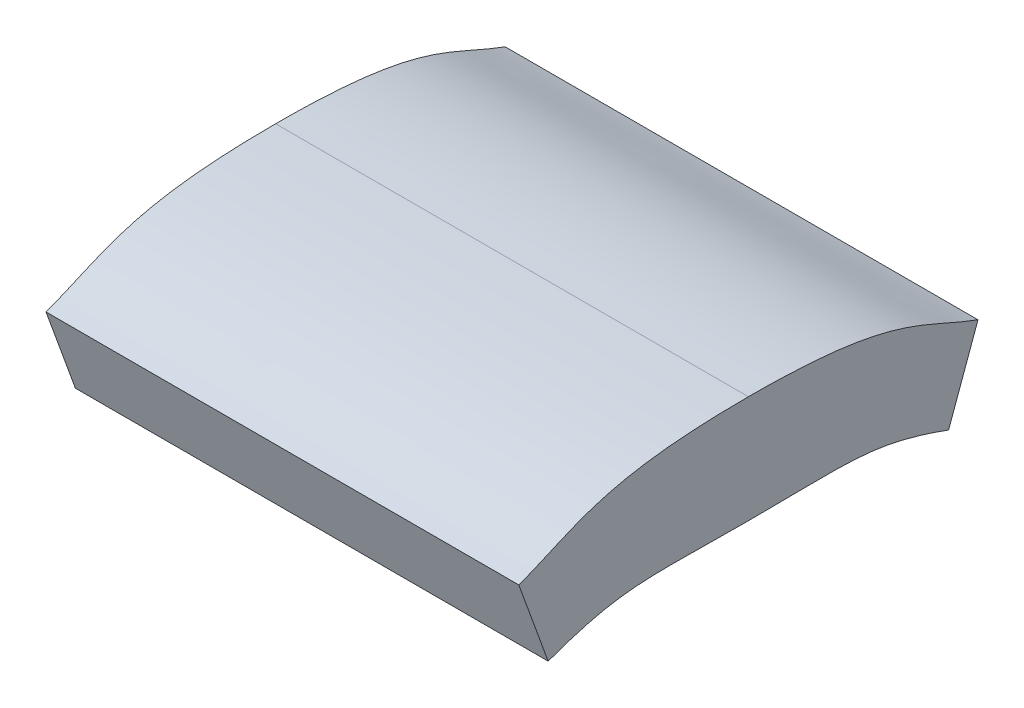
ISO-10303-21;
HEADER;
FILE_DESCRIPTION(('STEP AP214'),'2;1');
FILE_NAME('part.step','',(''),(''),'','','');
FILE_SCHEMA(('AUTOMOTIVE_DESIGN { 1 0 10303 214 1 1 1 1 }'));
ENDSEC;
DATA;
#1=APPLICATION_CONTEXT('core data for automotive mechanical design processes');
#2=APPLICATION_PROTOCOL_DEFINITION('international standard','automotive_design',2000,#1);
#3=PRODUCT_CONTEXT('',#1,'mechanical');
#4=PRODUCT('Part','Part','',(#3));
#5=PRODUCT_RELATED_PRODUCT_CATEGORY('part','',(#4));
#6=PRODUCT_DEFINITION_FORMATION('','',#4);
#7=PRODUCT_DEFINITION_CONTEXT('part definition',#1,'design');
#8=PRODUCT_DEFINITION('design','',#6,#7);
#9=PRODUCT_DEFINITION_SHAPE('','',#8);
#10=(LENGTH_UNIT() NAMED_UNIT(*) SI_UNIT(.MILLI.,.METRE.));
#11=(NAMED_UNIT(*) PLANE_ANGLE_UNIT() SI_UNIT($,.RADIAN.));
#12=(NAMED_UNIT(*) SI_UNIT($,.STERADIAN.) SOLID_ANGLE_UNIT());
#13=UNCERTAINTY_MEASURE_WITH_UNIT(LENGTH_MEASURE(1.E-05),#10,'distance_accuracy_value','');
#14=(GEOMETRIC_REPRESENTATION_CONTEXT(3) GLOBAL_UNCERTAINTY_ASSIGNED_CONTEXT((#13)) GLOBAL_UNIT_ASSIGNED_CONTEXT((#10,
#11,#12)) REPRESENTATION_CONTEXT('',''));
#15=CARTESIAN_POINT('',(0.,0.,0.));
#16=DIRECTION('',(0.,0.,1.));
#17=DIRECTION('',(1.,0.,0.));
#18=AXIS2_PLACEMENT_3D('',#15,#16,#17);
#19=CARTESIAN_POINT('',(22.,0.0220731014368565,0.));
#20=CARTESIAN_POINT('',(22.,0.0220731014368516,-4.68519401212058));
#21=CARTESIAN_POINT('',(22.,0.312622202267794,-5.7702052001182));
#22=CARTESIAN_POINT('',(22.,-0.977926898563144,-9.31595971334866));
#23=B_SPLINE_CURVE_WITH_KNOTS('',3,(#19,#20,#21,#22),.UNSPECIFIED.,.F.,.F.,(4,4),(0.,1.),.UNSPECIFIED.);
#24=DIRECTION('',(-1.,0.,0.));
#25=VECTOR('',#24,1.);
#26=SURFACE_OF_LINEAR_EXTRUSION('',#23,#25);
#27=CARTESIAN_POINT('',(0.,0.0220731014368565,0.));
#28=CARTESIAN_POINT('',(0.,0.0220731014368516,-4.68519401212058));
#29=CARTESIAN_POINT('',(0.,0.312622202267794,-5.7702052001182));
#30=CARTESIAN_POINT('',(0.,-0.977926898563144,-9.31595971334866));
#31=B_SPLINE_CURVE_WITH_KNOTS('',3,(#27,#28,#29,#30),.UNSPECIFIED.,.F.,.F.,(4,4),(0.,1.),.UNSPECIFIED.);
#32=CARTESIAN_POINT('',(0.,0.0220731014368565,0.));
#33=VERTEX_POINT('',#32);
#34=CARTESIAN_POINT('',(0.,-0.977926898563144,-9.31595971334866));
#35=VERTEX_POINT('',#34);
#36=EDGE_CURVE('E124',#33,#35,#31,.T.);
#37=ORIENTED_EDGE('',*,*,#36,.T.);
#38=DIRECTION('',(-1.,0.,0.));
#39=VECTOR('',#38,1.);
#40=CARTESIAN_POINT('',(22.,-0.977926898563144,-9.31595971334866));
#41=LINE('',#40,#39);
#42=CARTESIAN_POINT('',(22.,-0.977926898563144,-9.31595971334866));
#43=VERTEX_POINT('',#42);
#44=EDGE_CURVE('E11',#43,#35,#41,.T.);
#45=ORIENTED_EDGE('',*,*,#44,.F.);
#46=CARTESIAN_POINT('',(22.,0.0220731014368565,0.));
#47=VERTEX_POINT('',#46);
#48=EDGE_CURVE('E153',#47,#43,#23,.T.);
#49=ORIENTED_EDGE('',*,*,#48,.F.);
#50=DIRECTION('',(-1.,0.,0.));
#51=VECTOR('',#50,1.);
#52=CARTESIAN_POINT('',(22.,0.0220731014368565,0.));
#53=LINE('',#52,#51);
#54=EDGE_CURVE('E114',#47,#33,#53,.T.);
#55=ORIENTED_EDGE('',*,*,#54,.T.);
#56=EDGE_LOOP('',(#37,#45,#49,#55));
#57=FACE_BOUND('',#56,.T.);
#58=ADVANCED_FACE('F33',(#57),#26,.F.);
#59=CARTESIAN_POINT('',(22.,-0.977926898563144,-9.31595971334866));
#60=DIRECTION('',(0.,0.342020143325669,0.939692620785908));
#61=DIRECTION('',(0.,-0.939692620785908,0.342020143325669));
#62=AXIS2_PLACEMENT_3D('',#59,#60,#61);
#63=PLANE('',#62);
#64=DIRECTION('',(0.,0.939692620785908,-0.342020143325669));
#65=VECTOR('',#64,1.);
#66=CARTESIAN_POINT('',(0.,-0.977926898563144,-9.31595971334866));
#67=LINE('',#66,#65);
#68=CARTESIAN_POINT('',(0.,2.78084358458049,-10.6840402866513));
#69=VERTEX_POINT('',#68);
#70=EDGE_CURVE('E178',#35,#69,#67,.T.);
#71=ORIENTED_EDGE('',*,*,#70,.T.);
#72=DIRECTION('',(-1.,0.,0.));
#73=VECTOR('',#72,1.);
#74=CARTESIAN_POINT('',(22.,2.78084358458049,-10.6840402866513));
#75=LINE('',#74,#73);
#76=CARTESIAN_POINT('',(22.,2.78084358458049,-10.6840402866513));
#77=VERTEX_POINT('',#76);
#78=EDGE_CURVE('E42',#77,#69,#75,.T.);
#79=ORIENTED_EDGE('',*,*,#78,.F.);
#80=DIRECTION('',(0.,0.939692620785908,-0.342020143325669));
#81=VECTOR('',#80,1.);
#82=CARTESIAN_POINT('',(22.,-0.977926898563144,-9.31595971334866));
#83=LINE('',#82,#81);
#84=EDGE_CURVE('E87',#43,#77,#83,.T.);
#85=ORIENTED_EDGE('',*,*,#84,.F.);
#86=ORIENTED_EDGE('',*,*,#44,.T.);
#87=EDGE_LOOP('',(#71,#79,#85,#86));
#88=FACE_BOUND('',#87,.T.);
#89=ADVANCED_FACE('F144',(#88),#63,.F.);
#90=CARTESIAN_POINT('',(22.,2.78084358458049,-10.6840402866513));
#91=CARTESIAN_POINT('',(22.,3.75213658486236,-8.01543470070257));
#92=CARTESIAN_POINT('',(22.,5.02207310143686,-6.88706405070165));
#93=CARTESIAN_POINT('',(22.,5.02207310143686,0.));
#94=B_SPLINE_CURVE_WITH_KNOTS('',3,(#90,#91,#92,#93),.UNSPECIFIED.,.F.,.F.,(4,4),(0.,1.),.UNSPECIFIED.);
#95=DIRECTION('',(-1.,0.,0.));
#96=VECTOR('',#95,1.);
#97=SURFACE_OF_LINEAR_EXTRUSION('',#94,#96);
#98=CARTESIAN_POINT('',(0.,2.78084358458049,-10.6840402866513));
#99=CARTESIAN_POINT('',(0.,3.75213658486236,-8.01543470070257));
#100=CARTESIAN_POINT('',(0.,5.02207310143686,-6.88706405070165));
#101=CARTESIAN_POINT('',(0.,5.02207310143686,0.));
#102=B_SPLINE_CURVE_WITH_KNOTS('',3,(#98,#99,#100,#101),.UNSPECIFIED.,.F.,.F.,(4,4),(0.,1.),.UNSPECIFIED.);
#103=CARTESIAN_POINT('',(0.,5.02207310143686,0.));
#104=VERTEX_POINT('',#103);
#105=EDGE_CURVE('E175',#69,#104,#102,.T.);
#106=ORIENTED_EDGE('',*,*,#105,.T.);
#107=DIRECTION('',(-1.,0.,0.));
#108=VECTOR('',#107,1.);
#109=CARTESIAN_POINT('',(22.,5.02207310143686,0.));
#110=LINE('',#109,#108);
#111=CARTESIAN_POINT('',(22.,5.02207310143686,0.));
#112=VERTEX_POINT('',#111);
#113=EDGE_CURVE('E109',#112,#104,#110,.T.);
#114=ORIENTED_EDGE('',*,*,#113,.F.);
#115=EDGE_CURVE('E100',#77,#112,#94,.T.);
#116=ORIENTED_EDGE('',*,*,#115,.F.);
#117=ORIENTED_EDGE('',*,*,#78,.T.);
#118=EDGE_LOOP('',(#106,#114,#116,#117));
#119=FACE_BOUND('',#118,.T.);
#120=ADVANCED_FACE('F142',(#119),#97,.F.);
#121=CARTESIAN_POINT('',(22.,5.02207310143686,0.));
#122=CARTESIAN_POINT('',(22.,5.02207310143686,6.88706405070165));
#123=CARTESIAN_POINT('',(22.,3.75213658486236,8.01543470070257));
#124=CARTESIAN_POINT('',(22.,2.78084358458049,10.6840402866513));
#125=B_SPLINE_CURVE_WITH_KNOTS('',3,(#121,#122,#123,#124),.UNSPECIFIED.,.F.,.F.,(4,4),(0.,1.),.UNSPECIFIED.);
#126=DIRECTION('',(-1.,0.,0.));
#127=VECTOR('',#126,1.);
#128=SURFACE_OF_LINEAR_EXTRUSION('',#125,#127);
#129=CARTESIAN_POINT('',(0.,5.02207310143686,0.));
#130=CARTESIAN_POINT('',(0.,5.02207310143686,6.88706405070165));
#131=CARTESIAN_POINT('',(0.,3.75213658486236,8.01543470070257));
#132=CARTESIAN_POINT('',(0.,2.78084358458049,10.6840402866513));
#133=B_SPLINE_CURVE_WITH_KNOTS('',3,(#129,#130,#131,#132),.UNSPECIFIED.,.F.,.F.,(4,4),(0.,1.),.UNSPECIFIED.);
#134=CARTESIAN_POINT('',(0.,2.78084358458049,10.6840402866513));
#135=VERTEX_POINT('',#134);
#136=EDGE_CURVE('E108',#104,#135,#133,.T.);
#137=ORIENTED_EDGE('',*,*,#136,.T.);
#138=DIRECTION('',(-1.,0.,0.));
#139=VECTOR('',#138,1.);
#140=CARTESIAN_POINT('',(22.,2.78084358458049,10.6840402866513));
#141=LINE('',#140,#139);
#142=CARTESIAN_POINT('',(22.,2.78084358458049,10.6840402866513));
#143=VERTEX_POINT('',#142);
#144=EDGE_CURVE('E105',#143,#135,#141,.T.);
#145=ORIENTED_EDGE('',*,*,#144,.F.);
#146=EDGE_CURVE('E94',#112,#143,#125,.T.);
#147=ORIENTED_EDGE('',*,*,#146,.F.);
#148=ORIENTED_EDGE('',*,*,#113,.T.);
#149=EDGE_LOOP('',(#137,#145,#147,#148));
#150=FACE_BOUND('',#149,.T.);
#151=ADVANCED_FACE('F106',(#150),#128,.F.);
#152=CARTESIAN_POINT('',(22.,-0.977926898563144,9.31595971334866));
#153=DIRECTION('',(0.,0.342020143325669,-0.939692620785908));
#154=DIRECTION('',(0.,0.939692620785908,0.342020143325669));
#155=AXIS2_PLACEMENT_3D('',#152,#153,#154);
#156=PLANE('',#155);
#157=DIRECTION('',(0.,-0.939692620785908,-0.342020143325669));
#158=VECTOR('',#157,1.);
#159=CARTESIAN_POINT('',(0.,-0.977926898563144,9.31595971334866));
#160=LINE('',#159,#158);
#161=CARTESIAN_POINT('',(0.,-0.977926898563144,9.31595971334866));
#162=VERTEX_POINT('',#161);
#163=EDGE_CURVE('E73',#135,#162,#160,.T.);
#164=ORIENTED_EDGE('',*,*,#163,.T.);
#165=DIRECTION('',(-1.,0.,0.));
#166=VECTOR('',#165,1.);
#167=CARTESIAN_POINT('',(22.,-0.977926898563144,9.31595971334866));
#168=LINE('',#167,#166);
#169=CARTESIAN_POINT('',(22.,-0.977926898563144,9.31595971334866));
#170=VERTEX_POINT('',#169);
#171=EDGE_CURVE('E110',#170,#162,#168,.T.);
#172=ORIENTED_EDGE('',*,*,#171,.F.);
#173=DIRECTION('',(0.,-0.939692620785908,-0.342020143325669));
#174=VECTOR('',#173,1.);
#175=CARTESIAN_POINT('',(22.,-0.977926898563144,9.31595971334866));
#176=LINE('',#175,#174);
#177=EDGE_CURVE('E98',#143,#170,#176,.T.);
#178=ORIENTED_EDGE('',*,*,#177,.F.);
#179=ORIENTED_EDGE('',*,*,#144,.T.);
#180=EDGE_LOOP('',(#164,#172,#178,#179));
#181=FACE_BOUND('',#180,.T.);
#182=ADVANCED_FACE('F112',(#181),#156,.F.);
#183=CARTESIAN_POINT('',(22.,-0.977926898563144,9.31595971334866));
#184=CARTESIAN_POINT('',(22.,0.312622202267794,5.7702052001182));
#185=CARTESIAN_POINT('',(22.,0.0220731014368516,4.68519401212058));
#186=CARTESIAN_POINT('',(22.,0.0220731014368565,0.));
#187=B_SPLINE_CURVE_WITH_KNOTS('',3,(#183,#184,#185,#186),.UNSPECIFIED.,.F.,.F.,(4,4),(0.,1.),.UNSPECIFIED.);
#188=DIRECTION('',(-1.,0.,0.));
#189=VECTOR('',#188,1.);
#190=SURFACE_OF_LINEAR_EXTRUSION('',#187,#189);
#191=CARTESIAN_POINT('',(0.,-0.977926898563144,9.31595971334866));
#192=CARTESIAN_POINT('',(0.,0.312622202267794,5.7702052001182));
#193=CARTESIAN_POINT('',(0.,0.0220731014368516,4.68519401212058));
#194=CARTESIAN_POINT('',(0.,0.0220731014368565,0.));
#195=B_SPLINE_CURVE_WITH_KNOTS('',3,(#191,#192,#193,#194),.UNSPECIFIED.,.F.,.F.,(4,4),(0.,1.),.UNSPECIFIED.);
#196=EDGE_CURVE('E79',#162,#33,#195,.T.);
#197=ORIENTED_EDGE('',*,*,#196,.T.);
#198=ORIENTED_EDGE('',*,*,#54,.F.);
#199=EDGE_CURVE('E50',#170,#47,#187,.T.);
#200=ORIENTED_EDGE('',*,*,#199,.F.);
#201=ORIENTED_EDGE('',*,*,#171,.T.);
#202=EDGE_LOOP('',(#197,#198,#200,#201));
#203=FACE_BOUND('',#202,.T.);
#204=ADVANCED_FACE('F132',(#203),#190,.F.);
#205=CARTESIAN_POINT('',(22.,0.00602901424845631,-5.08526966875812));
#206=DIRECTION('',(-1.,0.,0.));
#207=DIRECTION('',(0.,0.,1.));
#208=AXIS2_PLACEMENT_3D('',#205,#206,#207);
#209=PLANE('',#208);
#210=ORIENTED_EDGE('',*,*,#48,.T.);
#211=ORIENTED_EDGE('',*,*,#84,.T.);
#212=ORIENTED_EDGE('',*,*,#115,.T.);
#213=ORIENTED_EDGE('',*,*,#146,.T.);
#214=ORIENTED_EDGE('',*,*,#177,.T.);
#215=ORIENTED_EDGE('',*,*,#199,.T.);
#216=EDGE_LOOP('',(#210,#211,#212,#213,#214,#215));
#217=FACE_BOUND('',#216,.T.);
#218=ADVANCED_FACE('F96',(#217),#209,.F.);
#219=CARTESIAN_POINT('',(0.,0.00602901424845631,-5.08526966875812));
#220=DIRECTION('',(-1.,0.,0.));
#221=DIRECTION('',(0.,0.,1.));
#222=AXIS2_PLACEMENT_3D('',#219,#220,#221);
#223=PLANE('',#222);
#224=ORIENTED_EDGE('',*,*,#36,.F.);
#225=ORIENTED_EDGE('',*,*,#196,.F.);
#226=ORIENTED_EDGE('',*,*,#163,.F.);
#227=ORIENTED_EDGE('',*,*,#136,.F.);
#228=ORIENTED_EDGE('',*,*,#105,.F.);
#229=ORIENTED_EDGE('',*,*,#70,.F.);
#230=EDGE_LOOP('',(#224,#225,#226,#227,#228,#229));
#231=FACE_BOUND('',#230,.T.);
#232=ADVANCED_FACE('F136',(#231),#223,.T.);
#233=CLOSED_SHELL('',(#58,#89,#120,#151,#182,#204,#218,#232));
#234=MANIFOLD_SOLID_BREP('B2',#233);
#235=ADVANCED_BREP_SHAPE_REPRESENTATION('',(#18,#234),#14);
#236=SHAPE_DEFINITION_REPRESENTATION(#9,#235);
ENDSEC;
END-ISO-10303-21;
